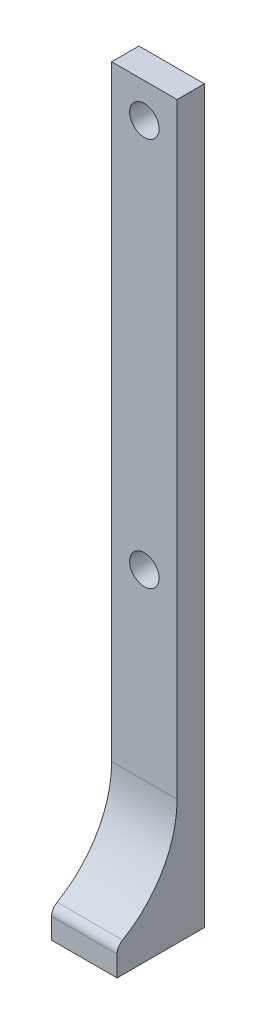
ISO-10303-21;
HEADER;
FILE_DESCRIPTION(('STEP AP214'),'2;1');
FILE_NAME('part.step','',(''),(''),'','','');
FILE_SCHEMA(('AUTOMOTIVE_DESIGN { 1 0 10303 214 1 1 1 1 }'));
ENDSEC;
DATA;
#1=APPLICATION_CONTEXT('core data for automotive mechanical design processes');
#2=APPLICATION_PROTOCOL_DEFINITION('international standard','automotive_design',2000,#1);
#3=PRODUCT_CONTEXT('',#1,'mechanical');
#4=PRODUCT('Part','Part','',(#3));
#5=PRODUCT_RELATED_PRODUCT_CATEGORY('part','',(#4));
#6=PRODUCT_DEFINITION_FORMATION('','',#4);
#7=PRODUCT_DEFINITION_CONTEXT('part definition',#1,'design');
#8=PRODUCT_DEFINITION('design','',#6,#7);
#9=PRODUCT_DEFINITION_SHAPE('','',#8);
#10=(LENGTH_UNIT() NAMED_UNIT(*) SI_UNIT(.MILLI.,.METRE.));
#11=(NAMED_UNIT(*) PLANE_ANGLE_UNIT() SI_UNIT($,.RADIAN.));
#12=(NAMED_UNIT(*) SI_UNIT($,.STERADIAN.) SOLID_ANGLE_UNIT());
#13=UNCERTAINTY_MEASURE_WITH_UNIT(LENGTH_MEASURE(1.E-05),#10,'distance_accuracy_value','');
#14=(GEOMETRIC_REPRESENTATION_CONTEXT(3) GLOBAL_UNCERTAINTY_ASSIGNED_CONTEXT((#13)) GLOBAL_UNIT_ASSIGNED_CONTEXT((#10,
#11,#12)) REPRESENTATION_CONTEXT('',''));
#15=CARTESIAN_POINT('',(0.,0.,0.));
#16=DIRECTION('',(0.,0.,1.));
#17=DIRECTION('',(1.,0.,0.));
#18=AXIS2_PLACEMENT_3D('',#15,#16,#17);
#19=CARTESIAN_POINT('',(0.,0.,2.5));
#20=DIRECTION('',(0.,0.,1.));
#21=DIRECTION('',(1.,0.,0.));
#22=AXIS2_PLACEMENT_3D('',#19,#20,#21);
#23=PLANE('',#22);
#24=CARTESIAN_POINT('',(-3.,-38.83625,2.5));
#25=DIRECTION('',(0.,0.,1.));
#26=DIRECTION('',(1.,0.,0.));
#27=AXIS2_PLACEMENT_3D('',#24,#25,#26);
#28=CIRCLE('',#27,1.35);
#29=CARTESIAN_POINT('',(-1.65,-38.83625,2.5));
#30=VERTEX_POINT('',#29);
#31=EDGE_CURVE('E121',#30,#30,#28,.T.);
#32=ORIENTED_EDGE('',*,*,#31,.F.);
#33=EDGE_LOOP('',(#32));
#34=FACE_BOUND('',#33,.T.);
#35=CARTESIAN_POINT('',(-3.,-3.16375,2.5));
#36=DIRECTION('',(0.,0.,1.));
#37=DIRECTION('',(1.,0.,0.));
#38=AXIS2_PLACEMENT_3D('',#35,#36,#37);
#39=CIRCLE('',#38,1.35);
#40=CARTESIAN_POINT('',(-1.65,-3.16375,2.5));
#41=VERTEX_POINT('',#40);
#42=EDGE_CURVE('E124',#41,#41,#39,.T.);
#43=ORIENTED_EDGE('',*,*,#42,.F.);
#44=EDGE_LOOP('',(#43));
#45=FACE_BOUND('',#44,.T.);
#46=DIRECTION('',(0.,-1.,0.));
#47=VECTOR('',#46,1.);
#48=CARTESIAN_POINT('',(-6.,0.,2.5));
#49=LINE('',#48,#47);
#50=CARTESIAN_POINT('',(-6.,0.,2.5));
#51=VERTEX_POINT('',#50);
#52=CARTESIAN_POINT('',(-5.99999999999999,-55.5697144502541,2.5));
#53=VERTEX_POINT('',#52);
#54=EDGE_CURVE('E131',#51,#53,#49,.T.);
#55=ORIENTED_EDGE('',*,*,#54,.T.);
#56=DIRECTION('',(1.,0.,0.));
#57=VECTOR('',#56,1.);
#58=CARTESIAN_POINT('',(0.,-55.5697144502541,2.5));
#59=LINE('',#58,#57);
#60=CARTESIAN_POINT('',(0.,-55.5697144502541,2.5));
#61=VERTEX_POINT('',#60);
#62=EDGE_CURVE('E154',#53,#61,#59,.T.);
#63=ORIENTED_EDGE('',*,*,#62,.T.);
#64=DIRECTION('',(0.,-1.,0.));
#65=VECTOR('',#64,1.);
#66=CARTESIAN_POINT('',(0.,0.,2.5));
#67=LINE('',#66,#65);
#68=CARTESIAN_POINT('',(0.,0.,2.5));
#69=VERTEX_POINT('',#68);
#70=EDGE_CURVE('E134',#69,#61,#67,.T.);
#71=ORIENTED_EDGE('',*,*,#70,.F.);
#72=DIRECTION('',(-1.,0.,0.));
#73=VECTOR('',#72,1.);
#74=CARTESIAN_POINT('',(0.,0.,2.5));
#75=LINE('',#74,#73);
#76=EDGE_CURVE('E128',#69,#51,#75,.T.);
#77=ORIENTED_EDGE('',*,*,#76,.T.);
#78=EDGE_LOOP('',(#55,#63,#71,#77));
#79=FACE_BOUND('',#78,.T.);
#80=ADVANCED_FACE('F35',(#34,#45,#79),#23,.T.);
#81=CARTESIAN_POINT('',(0.,0.,2.5));
#82=DIRECTION('',(0.,-1.,0.));
#83=DIRECTION('',(0.,0.,-1.));
#84=AXIS2_PLACEMENT_3D('',#81,#82,#83);
#85=PLANE('',#84);
#86=DIRECTION('',(-1.,0.,0.));
#87=VECTOR('',#86,1.);
#88=CARTESIAN_POINT('',(0.,0.,0.));
#89=LINE('',#88,#87);
#90=CARTESIAN_POINT('',(0.,0.,0.));
#91=VERTEX_POINT('',#90);
#92=CARTESIAN_POINT('',(-6.,0.,0.));
#93=VERTEX_POINT('',#92);
#94=EDGE_CURVE('E142',#91,#93,#89,.T.);
#95=ORIENTED_EDGE('',*,*,#94,.T.);
#96=DIRECTION('',(0.,0.,-1.));
#97=VECTOR('',#96,1.);
#98=CARTESIAN_POINT('',(-6.,0.,2.5));
#99=LINE('',#98,#97);
#100=EDGE_CURVE('E151',#51,#93,#99,.T.);
#101=ORIENTED_EDGE('',*,*,#100,.F.);
#102=ORIENTED_EDGE('',*,*,#76,.F.);
#103=DIRECTION('',(0.,0.,-1.));
#104=VECTOR('',#103,1.);
#105=CARTESIAN_POINT('',(0.,0.,2.5));
#106=LINE('',#105,#104);
#107=EDGE_CURVE('E113',#69,#91,#106,.T.);
#108=ORIENTED_EDGE('',*,*,#107,.T.);
#109=EDGE_LOOP('',(#95,#101,#102,#108));
#110=FACE_BOUND('',#109,.T.);
#111=ADVANCED_FACE('F173',(#110),#85,.F.);
#112=CARTESIAN_POINT('',(-6.,0.,2.5));
#113=DIRECTION('',(1.,0.,0.));
#114=DIRECTION('',(0.,1.,0.));
#115=AXIS2_PLACEMENT_3D('',#112,#113,#114);
#116=PLANE('',#115);
#117=DIRECTION('',(0.,-1.,0.));
#118=VECTOR('',#117,1.);
#119=CARTESIAN_POINT('',(-6.,-64.5,8.));
#120=LINE('',#119,#118);
#121=CARTESIAN_POINT('',(-6.,-65.0959938918829,8.));
#122=VERTEX_POINT('',#121);
#123=CARTESIAN_POINT('',(-6.,-67.,8.));
#124=VERTEX_POINT('',#123);
#125=EDGE_CURVE('E103',#122,#124,#120,.T.);
#126=ORIENTED_EDGE('',*,*,#125,.F.);
#127=CARTESIAN_POINT('',(-5.99999999999999,-65.0959938918829,7.));
#128=DIRECTION('',(1.,0.,0.));
#129=DIRECTION('',(0.,1.,0.));
#130=AXIS2_PLACEMENT_3D('',#127,#128,#129);
#131=CIRCLE('',#130,1.);
#132=CARTESIAN_POINT('',(-5.99999999999999,-64.2299684880985,7.49999999999999));
#133=VERTEX_POINT('',#132);
#134=EDGE_CURVE('E57',#122,#133,#131,.F.);
#135=ORIENTED_EDGE('',*,*,#134,.T.);
#136=CARTESIAN_POINT('',(-5.99999999999999,-55.5697144502541,12.5));
#137=DIRECTION('',(1.,0.,0.));
#138=DIRECTION('',(0.,1.,0.));
#139=AXIS2_PLACEMENT_3D('',#136,#137,#138);
#140=CIRCLE('',#139,10.);
#141=EDGE_CURVE('E159',#133,#53,#140,.T.);
#142=ORIENTED_EDGE('',*,*,#141,.T.);
#143=ORIENTED_EDGE('',*,*,#54,.F.);
#144=ORIENTED_EDGE('',*,*,#100,.T.);
#145=DIRECTION('',(0.,-1.,0.));
#146=VECTOR('',#145,1.);
#147=CARTESIAN_POINT('',(-6.,0.,0.));
#148=LINE('',#147,#146);
#149=CARTESIAN_POINT('',(-5.99999999999999,-67.,0.));
#150=VERTEX_POINT('',#149);
#151=EDGE_CURVE('E145',#93,#150,#148,.T.);
#152=ORIENTED_EDGE('',*,*,#151,.T.);
#153=DIRECTION('',(0.,0.,-1.));
#154=VECTOR('',#153,1.);
#155=CARTESIAN_POINT('',(-5.99999999999999,-67.,2.5));
#156=LINE('',#155,#154);
#157=EDGE_CURVE('E112',#124,#150,#156,.T.);
#158=ORIENTED_EDGE('',*,*,#157,.F.);
#159=EDGE_LOOP('',(#126,#135,#142,#143,#144,#152,#158));
#160=FACE_BOUND('',#159,.T.);
#161=ADVANCED_FACE('F164',(#160),#116,.F.);
#162=CARTESIAN_POINT('',(0.,-67.,2.5));
#163=DIRECTION('',(0.,1.,0.));
#164=DIRECTION('',(0.,0.,1.));
#165=AXIS2_PLACEMENT_3D('',#162,#163,#164);
#166=PLANE('',#165);
#167=DIRECTION('',(1.,0.,0.));
#168=VECTOR('',#167,1.);
#169=CARTESIAN_POINT('',(0.,-67.,0.));
#170=LINE('',#169,#168);
#171=CARTESIAN_POINT('',(0.,-67.,0.));
#172=VERTEX_POINT('',#171);
#173=EDGE_CURVE('E111',#150,#172,#170,.T.);
#174=ORIENTED_EDGE('',*,*,#173,.T.);
#175=DIRECTION('',(0.,0.,-1.));
#176=VECTOR('',#175,1.);
#177=CARTESIAN_POINT('',(0.,-67.,2.5));
#178=LINE('',#177,#176);
#179=CARTESIAN_POINT('',(0.,-67.,8.));
#180=VERTEX_POINT('',#179);
#181=EDGE_CURVE('E96',#180,#172,#178,.T.);
#182=ORIENTED_EDGE('',*,*,#181,.F.);
#183=DIRECTION('',(-1.,0.,0.));
#184=VECTOR('',#183,1.);
#185=CARTESIAN_POINT('',(0.,-67.,8.));
#186=LINE('',#185,#184);
#187=EDGE_CURVE('E104',#180,#124,#186,.T.);
#188=ORIENTED_EDGE('',*,*,#187,.T.);
#189=ORIENTED_EDGE('',*,*,#157,.T.);
#190=EDGE_LOOP('',(#174,#182,#188,#189));
#191=FACE_BOUND('',#190,.T.);
#192=ADVANCED_FACE('F108',(#191),#166,.F.);
#193=CARTESIAN_POINT('',(-3.,-3.16375,2.5));
#194=DIRECTION('',(0.,0.,-1.));
#195=DIRECTION('',(-1.,0.,0.));
#196=AXIS2_PLACEMENT_3D('',#193,#194,#195);
#197=CYLINDRICAL_SURFACE('',#196,1.35);
#198=ORIENTED_EDGE('',*,*,#42,.T.);
#199=EDGE_LOOP('',(#198));
#200=FACE_BOUND('',#199,.T.);
#201=CARTESIAN_POINT('',(-3.,-3.16375,0.));
#202=DIRECTION('',(0.,0.,1.));
#203=DIRECTION('',(1.,0.,0.));
#204=AXIS2_PLACEMENT_3D('',#201,#202,#203);
#205=CIRCLE('',#204,1.35);
#206=CARTESIAN_POINT('',(-1.65,-3.16375,0.));
#207=VERTEX_POINT('',#206);
#208=EDGE_CURVE('E139',#207,#207,#205,.T.);
#209=ORIENTED_EDGE('',*,*,#208,.F.);
#210=EDGE_LOOP('',(#209));
#211=FACE_BOUND('',#210,.T.);
#212=ADVANCED_FACE('F199',(#200,#211),#197,.F.);
#213=CARTESIAN_POINT('',(-3.,-38.83625,2.5));
#214=DIRECTION('',(0.,0.,-1.));
#215=DIRECTION('',(-1.,0.,0.));
#216=AXIS2_PLACEMENT_3D('',#213,#214,#215);
#217=CYLINDRICAL_SURFACE('',#216,1.35);
#218=ORIENTED_EDGE('',*,*,#31,.T.);
#219=EDGE_LOOP('',(#218));
#220=FACE_BOUND('',#219,.T.);
#221=CARTESIAN_POINT('',(-3.,-38.83625,0.));
#222=DIRECTION('',(0.,0.,1.));
#223=DIRECTION('',(1.,0.,0.));
#224=AXIS2_PLACEMENT_3D('',#221,#222,#223);
#225=CIRCLE('',#224,1.35);
#226=CARTESIAN_POINT('',(-1.65,-38.83625,0.));
#227=VERTEX_POINT('',#226);
#228=EDGE_CURVE('E119',#227,#227,#225,.T.);
#229=ORIENTED_EDGE('',*,*,#228,.F.);
#230=EDGE_LOOP('',(#229));
#231=FACE_BOUND('',#230,.T.);
#232=ADVANCED_FACE('F196',(#220,#231),#217,.F.);
#233=CARTESIAN_POINT('',(0.,0.,2.5));
#234=DIRECTION('',(1.,0.,0.));
#235=DIRECTION('',(0.,1.,0.));
#236=AXIS2_PLACEMENT_3D('',#233,#234,#235);
#237=PLANE('',#236);
#238=CARTESIAN_POINT('',(0.,-55.5697144502541,12.5));
#239=DIRECTION('',(1.,0.,0.));
#240=DIRECTION('',(0.,1.,0.));
#241=AXIS2_PLACEMENT_3D('',#238,#239,#240);
#242=CIRCLE('',#241,10.);
#243=CARTESIAN_POINT('',(0.,-64.2299684880985,7.49999999999999));
#244=VERTEX_POINT('',#243);
#245=EDGE_CURVE('E157',#61,#244,#242,.F.);
#246=ORIENTED_EDGE('',*,*,#245,.T.);
#247=CARTESIAN_POINT('',(0.,-65.0959938918829,7.));
#248=DIRECTION('',(1.,0.,0.));
#249=DIRECTION('',(0.,1.,0.));
#250=AXIS2_PLACEMENT_3D('',#247,#248,#249);
#251=CIRCLE('',#250,1.);
#252=CARTESIAN_POINT('',(0.,-65.0959938918829,8.));
#253=VERTEX_POINT('',#252);
#254=EDGE_CURVE('E11',#244,#253,#251,.T.);
#255=ORIENTED_EDGE('',*,*,#254,.T.);
#256=DIRECTION('',(0.,-1.,0.));
#257=VECTOR('',#256,1.);
#258=CARTESIAN_POINT('',(0.,-64.5,8.));
#259=LINE('',#258,#257);
#260=EDGE_CURVE('E92',#253,#180,#259,.T.);
#261=ORIENTED_EDGE('',*,*,#260,.T.);
#262=ORIENTED_EDGE('',*,*,#181,.T.);
#263=DIRECTION('',(0.,-1.,0.));
#264=VECTOR('',#263,1.);
#265=CARTESIAN_POINT('',(0.,0.,0.));
#266=LINE('',#265,#264);
#267=EDGE_CURVE('E125',#91,#172,#266,.T.);
#268=ORIENTED_EDGE('',*,*,#267,.F.);
#269=ORIENTED_EDGE('',*,*,#107,.F.);
#270=ORIENTED_EDGE('',*,*,#70,.T.);
#271=EDGE_LOOP('',(#246,#255,#261,#262,#268,#269,#270));
#272=FACE_BOUND('',#271,.T.);
#273=ADVANCED_FACE('F94',(#272),#237,.T.);
#274=CARTESIAN_POINT('',(0.,0.,0.));
#275=DIRECTION('',(0.,0.,1.));
#276=DIRECTION('',(1.,0.,0.));
#277=AXIS2_PLACEMENT_3D('',#274,#275,#276);
#278=PLANE('',#277);
#279=ORIENTED_EDGE('',*,*,#173,.F.);
#280=ORIENTED_EDGE('',*,*,#151,.F.);
#281=ORIENTED_EDGE('',*,*,#94,.F.);
#282=ORIENTED_EDGE('',*,*,#267,.T.);
#283=EDGE_LOOP('',(#279,#280,#281,#282));
#284=FACE_BOUND('',#283,.T.);
#285=ORIENTED_EDGE('',*,*,#208,.T.);
#286=EDGE_LOOP('',(#285));
#287=FACE_BOUND('',#286,.T.);
#288=ORIENTED_EDGE('',*,*,#228,.T.);
#289=EDGE_LOOP('',(#288));
#290=FACE_BOUND('',#289,.T.);
#291=ADVANCED_FACE('F166',(#284,#287,#290),#278,.F.);
#292=CARTESIAN_POINT('',(0.,-64.5,8.));
#293=DIRECTION('',(0.,0.,1.));
#294=DIRECTION('',(1.,0.,0.));
#295=AXIS2_PLACEMENT_3D('',#292,#293,#294);
#296=PLANE('',#295);
#297=ORIENTED_EDGE('',*,*,#260,.F.);
#298=DIRECTION('',(1.,0.,0.));
#299=VECTOR('',#298,1.);
#300=CARTESIAN_POINT('',(-6.,-65.0959938918829,8.));
#301=LINE('',#300,#299);
#302=EDGE_CURVE('E161',#253,#122,#301,.F.);
#303=ORIENTED_EDGE('',*,*,#302,.T.);
#304=ORIENTED_EDGE('',*,*,#125,.T.);
#305=ORIENTED_EDGE('',*,*,#187,.F.);
#306=EDGE_LOOP('',(#297,#303,#304,#305));
#307=FACE_BOUND('',#306,.T.);
#308=ADVANCED_FACE('F115',(#307),#296,.T.);
#309=CARTESIAN_POINT('',(0.,-55.5697144502541,12.5));
#310=DIRECTION('',(-1.,0.,0.));
#311=DIRECTION('',(0.,0.,1.));
#312=AXIS2_PLACEMENT_3D('',#309,#310,#311);
#313=CYLINDRICAL_SURFACE('',#312,10.);
#314=ORIENTED_EDGE('',*,*,#141,.F.);
#315=DIRECTION('',(-1.,0.,0.));
#316=VECTOR('',#315,1.);
#317=CARTESIAN_POINT('',(0.,-64.2299684880985,7.5));
#318=LINE('',#317,#316);
#319=EDGE_CURVE('E43',#133,#244,#318,.F.);
#320=ORIENTED_EDGE('',*,*,#319,.T.);
#321=ORIENTED_EDGE('',*,*,#245,.F.);
#322=ORIENTED_EDGE('',*,*,#62,.F.);
#323=EDGE_LOOP('',(#314,#320,#321,#322));
#324=FACE_BOUND('',#323,.T.);
#325=ADVANCED_FACE('F176',(#324),#313,.F.);
#326=CARTESIAN_POINT('',(0.,-65.0959938918829,7.));
#327=DIRECTION('',(-1.,0.,0.));
#328=DIRECTION('',(0.,0.,1.));
#329=AXIS2_PLACEMENT_3D('',#326,#327,#328);
#330=CYLINDRICAL_SURFACE('',#329,1.);
#331=ORIENTED_EDGE('',*,*,#254,.F.);
#332=ORIENTED_EDGE('',*,*,#319,.F.);
#333=ORIENTED_EDGE('',*,*,#134,.F.);
#334=ORIENTED_EDGE('',*,*,#302,.F.);
#335=EDGE_LOOP('',(#331,#332,#333,#334));
#336=FACE_BOUND('',#335,.T.);
#337=ADVANCED_FACE('F37',(#336),#330,.T.);
#338=CLOSED_SHELL('',(#80,#111,#161,#192,#212,#232,#273,#291,#308,#325,#337));
#339=MANIFOLD_SOLID_BREP('B2',#338);
#340=ADVANCED_BREP_SHAPE_REPRESENTATION('',(#18,#339),#14);
#341=SHAPE_DEFINITION_REPRESENTATION(#9,#340);
ENDSEC;
END-ISO-10303-21;
